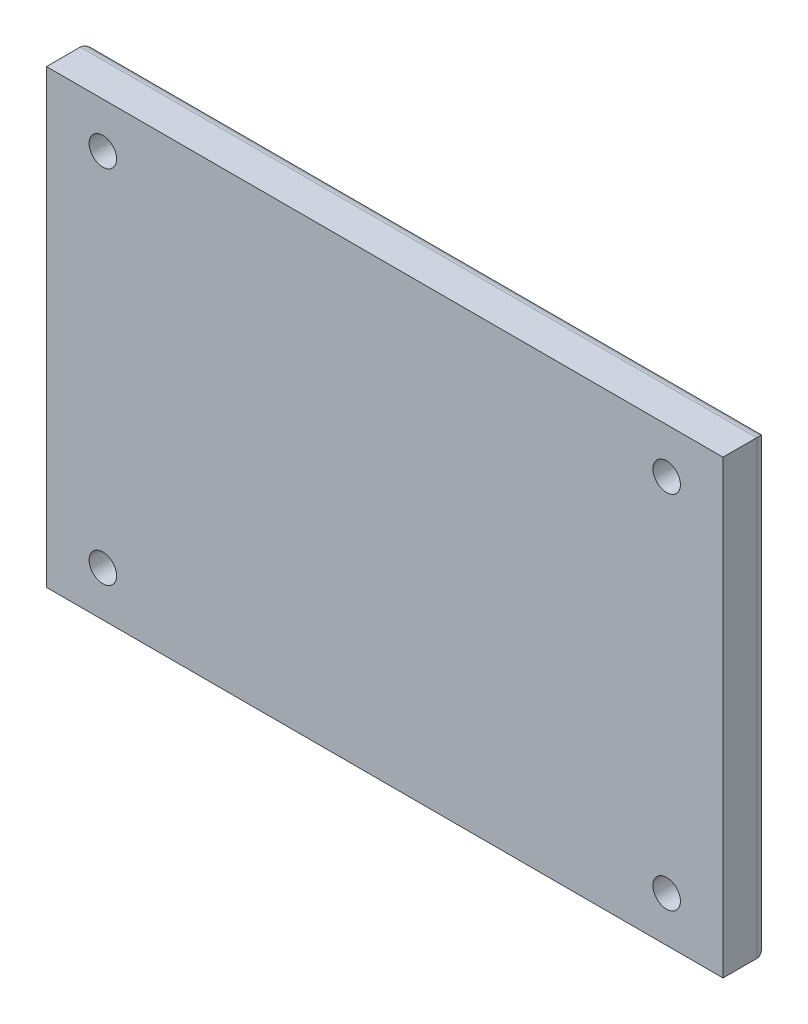
ISO-10303-21;
HEADER;
FILE_DESCRIPTION(('STEP AP214'),'2;1');
FILE_NAME('part.step','',(''),(''),'','','');
FILE_SCHEMA(('AUTOMOTIVE_DESIGN { 1 0 10303 214 1 1 1 1 }'));
ENDSEC;
DATA;
#1=APPLICATION_CONTEXT('core data for automotive mechanical design processes');
#2=APPLICATION_PROTOCOL_DEFINITION('international standard','automotive_design',2000,#1);
#3=PRODUCT_CONTEXT('',#1,'mechanical');
#4=PRODUCT('Part','Part','',(#3));
#5=PRODUCT_RELATED_PRODUCT_CATEGORY('part','',(#4));
#6=PRODUCT_DEFINITION_FORMATION('','',#4);
#7=PRODUCT_DEFINITION_CONTEXT('part definition',#1,'design');
#8=PRODUCT_DEFINITION('design','',#6,#7);
#9=PRODUCT_DEFINITION_SHAPE('','',#8);
#10=(LENGTH_UNIT() NAMED_UNIT(*) SI_UNIT(.MILLI.,.METRE.));
#11=(NAMED_UNIT(*) PLANE_ANGLE_UNIT() SI_UNIT($,.RADIAN.));
#12=(NAMED_UNIT(*) SI_UNIT($,.STERADIAN.) SOLID_ANGLE_UNIT());
#13=UNCERTAINTY_MEASURE_WITH_UNIT(LENGTH_MEASURE(1.E-05),#10,'distance_accuracy_value','');
#14=(GEOMETRIC_REPRESENTATION_CONTEXT(3) GLOBAL_UNCERTAINTY_ASSIGNED_CONTEXT((#13)) GLOBAL_UNIT_ASSIGNED_CONTEXT((#10,
#11,#12)) REPRESENTATION_CONTEXT('',''));
#15=CARTESIAN_POINT('',(0.,0.,0.));
#16=DIRECTION('',(0.,0.,1.));
#17=DIRECTION('',(1.,0.,0.));
#18=AXIS2_PLACEMENT_3D('',#15,#16,#17);
#19=CARTESIAN_POINT('',(30.,20.,4.));
#20=DIRECTION('',(-1.,0.,0.));
#21=DIRECTION('',(0.,0.,1.));
#22=AXIS2_PLACEMENT_3D('',#19,#20,#21);
#23=PLANE('',#22);
#24=DIRECTION('',(0.,0.,-1.));
#25=VECTOR('',#24,1.);
#26=CARTESIAN_POINT('',(30.,-20.,4.));
#27=LINE('',#26,#25);
#28=CARTESIAN_POINT('',(30.,-20.,4.));
#29=VERTEX_POINT('',#28);
#30=CARTESIAN_POINT('',(30.,-20.,1.));
#31=VERTEX_POINT('',#30);
#32=EDGE_CURVE('E192',#29,#31,#27,.T.);
#33=ORIENTED_EDGE('',*,*,#32,.T.);
#34=DIRECTION('',(0.,1.,0.));
#35=VECTOR('',#34,1.);
#36=CARTESIAN_POINT('',(30.,20.,1.));
#37=LINE('',#36,#35);
#38=CARTESIAN_POINT('',(30.,20.,1.));
#39=VERTEX_POINT('',#38);
#40=EDGE_CURVE('E13',#31,#39,#37,.T.);
#41=ORIENTED_EDGE('',*,*,#40,.T.);
#42=DIRECTION('',(0.,0.,-1.));
#43=VECTOR('',#42,1.);
#44=CARTESIAN_POINT('',(30.,20.,4.));
#45=LINE('',#44,#43);
#46=CARTESIAN_POINT('',(30.,20.,4.));
#47=VERTEX_POINT('',#46);
#48=EDGE_CURVE('E109',#47,#39,#45,.T.);
#49=ORIENTED_EDGE('',*,*,#48,.F.);
#50=DIRECTION('',(0.,1.,0.));
#51=VECTOR('',#50,1.);
#52=CARTESIAN_POINT('',(30.,20.,4.));
#53=LINE('',#52,#51);
#54=EDGE_CURVE('E115',#29,#47,#53,.T.);
#55=ORIENTED_EDGE('',*,*,#54,.F.);
#56=EDGE_LOOP('',(#33,#41,#49,#55));
#57=FACE_BOUND('',#56,.T.);
#58=ADVANCED_FACE('F48',(#57),#23,.F.);
#59=CARTESIAN_POINT('',(-30.,20.,4.));
#60=DIRECTION('',(0.,-1.,0.));
#61=DIRECTION('',(0.,0.,-1.));
#62=AXIS2_PLACEMENT_3D('',#59,#60,#61);
#63=PLANE('',#62);
#64=ORIENTED_EDGE('',*,*,#48,.T.);
#65=DIRECTION('',(-1.,0.,0.));
#66=VECTOR('',#65,1.);
#67=CARTESIAN_POINT('',(-30.,20.,1.));
#68=LINE('',#67,#66);
#69=CARTESIAN_POINT('',(-30.,20.,1.));
#70=VERTEX_POINT('',#69);
#71=EDGE_CURVE('E125',#39,#70,#68,.T.);
#72=ORIENTED_EDGE('',*,*,#71,.T.);
#73=DIRECTION('',(0.,0.,-1.));
#74=VECTOR('',#73,1.);
#75=CARTESIAN_POINT('',(-30.,20.,4.));
#76=LINE('',#75,#74);
#77=CARTESIAN_POINT('',(-30.,20.,4.));
#78=VERTEX_POINT('',#77);
#79=EDGE_CURVE('E111',#78,#70,#76,.T.);
#80=ORIENTED_EDGE('',*,*,#79,.F.);
#81=DIRECTION('',(-1.,0.,0.));
#82=VECTOR('',#81,1.);
#83=CARTESIAN_POINT('',(-30.,20.,4.));
#84=LINE('',#83,#82);
#85=EDGE_CURVE('E104',#47,#78,#84,.T.);
#86=ORIENTED_EDGE('',*,*,#85,.F.);
#87=EDGE_LOOP('',(#64,#72,#80,#86));
#88=FACE_BOUND('',#87,.T.);
#89=ADVANCED_FACE('F106',(#88),#63,.F.);
#90=CARTESIAN_POINT('',(-30.,20.,4.));
#91=DIRECTION('',(1.,0.,0.));
#92=DIRECTION('',(0.,0.,-1.));
#93=AXIS2_PLACEMENT_3D('',#90,#91,#92);
#94=PLANE('',#93);
#95=ORIENTED_EDGE('',*,*,#79,.T.);
#96=DIRECTION('',(0.,-1.,0.));
#97=VECTOR('',#96,1.);
#98=CARTESIAN_POINT('',(-30.,20.,1.));
#99=LINE('',#98,#97);
#100=CARTESIAN_POINT('',(-30.,-20.,1.));
#101=VERTEX_POINT('',#100);
#102=EDGE_CURVE('E72',#70,#101,#99,.T.);
#103=ORIENTED_EDGE('',*,*,#102,.T.);
#104=DIRECTION('',(0.,0.,-1.));
#105=VECTOR('',#104,1.);
#106=CARTESIAN_POINT('',(-30.,-20.,4.));
#107=LINE('',#106,#105);
#108=CARTESIAN_POINT('',(-30.,-20.,4.));
#109=VERTEX_POINT('',#108);
#110=EDGE_CURVE('E129',#109,#101,#107,.T.);
#111=ORIENTED_EDGE('',*,*,#110,.F.);
#112=DIRECTION('',(0.,-1.,0.));
#113=VECTOR('',#112,1.);
#114=CARTESIAN_POINT('',(-30.,20.,4.));
#115=LINE('',#114,#113);
#116=EDGE_CURVE('E114',#78,#109,#115,.T.);
#117=ORIENTED_EDGE('',*,*,#116,.F.);
#118=EDGE_LOOP('',(#95,#103,#111,#117));
#119=FACE_BOUND('',#118,.T.);
#120=ADVANCED_FACE('F222',(#119),#94,.F.);
#121=CARTESIAN_POINT('',(-30.,-20.,4.));
#122=DIRECTION('',(0.,1.,0.));
#123=DIRECTION('',(0.,0.,1.));
#124=AXIS2_PLACEMENT_3D('',#121,#122,#123);
#125=PLANE('',#124);
#126=ORIENTED_EDGE('',*,*,#110,.T.);
#127=DIRECTION('',(1.,0.,0.));
#128=VECTOR('',#127,1.);
#129=CARTESIAN_POINT('',(-30.,-20.,1.));
#130=LINE('',#129,#128);
#131=EDGE_CURVE('E57',#101,#31,#130,.T.);
#132=ORIENTED_EDGE('',*,*,#131,.T.);
#133=ORIENTED_EDGE('',*,*,#32,.F.);
#134=DIRECTION('',(1.,0.,0.));
#135=VECTOR('',#134,1.);
#136=CARTESIAN_POINT('',(-30.,-20.,4.));
#137=LINE('',#136,#135);
#138=EDGE_CURVE('E120',#109,#29,#137,.T.);
#139=ORIENTED_EDGE('',*,*,#138,.F.);
#140=EDGE_LOOP('',(#126,#132,#133,#139));
#141=FACE_BOUND('',#140,.T.);
#142=ADVANCED_FACE('F193',(#141),#125,.F.);
#143=CARTESIAN_POINT('',(0.,0.,4.));
#144=DIRECTION('',(0.,0.,1.));
#145=DIRECTION('',(1.,0.,0.));
#146=AXIS2_PLACEMENT_3D('',#143,#144,#145);
#147=PLANE('',#146);
#148=CARTESIAN_POINT('',(-25.,-16.,4.));
#149=DIRECTION('',(0.,0.,1.));
#150=DIRECTION('',(1.,0.,0.));
#151=AXIS2_PLACEMENT_3D('',#148,#149,#150);
#152=CIRCLE('',#151,1.2192);
#153=CARTESIAN_POINT('',(-23.7808,-16.,4.));
#154=VERTEX_POINT('',#153);
#155=EDGE_CURVE('E52',#154,#154,#152,.T.);
#156=ORIENTED_EDGE('',*,*,#155,.F.);
#157=EDGE_LOOP('',(#156));
#158=FACE_BOUND('',#157,.T.);
#159=CARTESIAN_POINT('',(-25.,16.,4.));
#160=DIRECTION('',(0.,0.,1.));
#161=DIRECTION('',(1.,0.,0.));
#162=AXIS2_PLACEMENT_3D('',#159,#160,#161);
#163=CIRCLE('',#162,1.2192);
#164=CARTESIAN_POINT('',(-23.7808,16.,4.));
#165=VERTEX_POINT('',#164);
#166=EDGE_CURVE('E160',#165,#165,#163,.T.);
#167=ORIENTED_EDGE('',*,*,#166,.F.);
#168=EDGE_LOOP('',(#167));
#169=FACE_BOUND('',#168,.T.);
#170=CARTESIAN_POINT('',(25.,16.,4.));
#171=DIRECTION('',(0.,0.,1.));
#172=DIRECTION('',(1.,0.,0.));
#173=AXIS2_PLACEMENT_3D('',#170,#171,#172);
#174=CIRCLE('',#173,1.2192);
#175=CARTESIAN_POINT('',(26.2192,16.,4.));
#176=VERTEX_POINT('',#175);
#177=EDGE_CURVE('E156',#176,#176,#174,.T.);
#178=ORIENTED_EDGE('',*,*,#177,.F.);
#179=EDGE_LOOP('',(#178));
#180=FACE_BOUND('',#179,.T.);
#181=CARTESIAN_POINT('',(25.,-16.,4.));
#182=DIRECTION('',(0.,0.,1.));
#183=DIRECTION('',(1.,0.,0.));
#184=AXIS2_PLACEMENT_3D('',#181,#182,#183);
#185=CIRCLE('',#184,1.2192);
#186=CARTESIAN_POINT('',(26.2192,-16.,4.));
#187=VERTEX_POINT('',#186);
#188=EDGE_CURVE('E146',#187,#187,#185,.T.);
#189=ORIENTED_EDGE('',*,*,#188,.F.);
#190=EDGE_LOOP('',(#189));
#191=FACE_BOUND('',#190,.T.);
#192=ORIENTED_EDGE('',*,*,#54,.T.);
#193=ORIENTED_EDGE('',*,*,#85,.T.);
#194=ORIENTED_EDGE('',*,*,#116,.T.);
#195=ORIENTED_EDGE('',*,*,#138,.T.);
#196=EDGE_LOOP('',(#192,#193,#194,#195));
#197=FACE_BOUND('',#196,.T.);
#198=ADVANCED_FACE('F118',(#158,#169,#180,#191,#197),#147,.T.);
#199=CARTESIAN_POINT('',(0.,0.,0.));
#200=DIRECTION('',(0.,0.,1.));
#201=DIRECTION('',(1.,0.,0.));
#202=AXIS2_PLACEMENT_3D('',#199,#200,#201);
#203=PLANE('',#202);
#204=CARTESIAN_POINT('',(-25.,-16.,0.));
#205=DIRECTION('',(0.,0.,-1.));
#206=DIRECTION('',(-1.,0.,0.));
#207=AXIS2_PLACEMENT_3D('',#204,#205,#206);
#208=CIRCLE('',#207,2.38125);
#209=CARTESIAN_POINT('',(-27.38125,-16.,0.));
#210=VERTEX_POINT('',#209);
#211=EDGE_CURVE('E402',#210,#210,#208,.T.);
#212=ORIENTED_EDGE('',*,*,#211,.F.);
#213=EDGE_LOOP('',(#212));
#214=FACE_BOUND('',#213,.T.);
#215=CARTESIAN_POINT('',(-25.,16.,0.));
#216=DIRECTION('',(0.,0.,-1.));
#217=DIRECTION('',(-1.,0.,0.));
#218=AXIS2_PLACEMENT_3D('',#215,#216,#217);
#219=CIRCLE('',#218,2.38125);
#220=CARTESIAN_POINT('',(-27.38125,16.,0.));
#221=VERTEX_POINT('',#220);
#222=EDGE_CURVE('E175',#221,#221,#219,.T.);
#223=ORIENTED_EDGE('',*,*,#222,.F.);
#224=EDGE_LOOP('',(#223));
#225=FACE_BOUND('',#224,.T.);
#226=CARTESIAN_POINT('',(25.,16.,0.));
#227=DIRECTION('',(0.,0.,-1.));
#228=DIRECTION('',(-1.,0.,0.));
#229=AXIS2_PLACEMENT_3D('',#226,#227,#228);
#230=CIRCLE('',#229,2.38125);
#231=CARTESIAN_POINT('',(22.61875,16.,0.));
#232=VERTEX_POINT('',#231);
#233=EDGE_CURVE('E162',#232,#232,#230,.T.);
#234=ORIENTED_EDGE('',*,*,#233,.F.);
#235=EDGE_LOOP('',(#234));
#236=FACE_BOUND('',#235,.T.);
#237=CARTESIAN_POINT('',(25.,-16.,0.));
#238=DIRECTION('',(0.,0.,-1.));
#239=DIRECTION('',(-1.,0.,0.));
#240=AXIS2_PLACEMENT_3D('',#237,#238,#239);
#241=CIRCLE('',#240,2.38125);
#242=CARTESIAN_POINT('',(22.61875,-16.,0.));
#243=VERTEX_POINT('',#242);
#244=EDGE_CURVE('E158',#243,#243,#241,.T.);
#245=ORIENTED_EDGE('',*,*,#244,.F.);
#246=EDGE_LOOP('',(#245));
#247=FACE_BOUND('',#246,.T.);
#248=DIRECTION('',(0.,-1.,0.));
#249=VECTOR('',#248,1.);
#250=CARTESIAN_POINT('',(-29.,0.,0.));
#251=LINE('',#250,#249);
#252=CARTESIAN_POINT('',(-29.,-19.,0.));
#253=VERTEX_POINT('',#252);
#254=CARTESIAN_POINT('',(-29.,19.,0.));
#255=VERTEX_POINT('',#254);
#256=EDGE_CURVE('E136',#253,#255,#251,.F.);
#257=ORIENTED_EDGE('',*,*,#256,.T.);
#258=DIRECTION('',(-1.,0.,0.));
#259=VECTOR('',#258,1.);
#260=CARTESIAN_POINT('',(0.,19.,0.));
#261=LINE('',#260,#259);
#262=CARTESIAN_POINT('',(29.,19.,0.));
#263=VERTEX_POINT('',#262);
#264=EDGE_CURVE('E138',#255,#263,#261,.F.);
#265=ORIENTED_EDGE('',*,*,#264,.T.);
#266=DIRECTION('',(0.,1.,0.));
#267=VECTOR('',#266,1.);
#268=CARTESIAN_POINT('',(29.,0.,0.));
#269=LINE('',#268,#267);
#270=CARTESIAN_POINT('',(29.,-19.,0.));
#271=VERTEX_POINT('',#270);
#272=EDGE_CURVE('E127',#263,#271,#269,.F.);
#273=ORIENTED_EDGE('',*,*,#272,.T.);
#274=DIRECTION('',(1.,0.,0.));
#275=VECTOR('',#274,1.);
#276=CARTESIAN_POINT('',(0.,-19.,0.));
#277=LINE('',#276,#275);
#278=EDGE_CURVE('E134',#271,#253,#277,.F.);
#279=ORIENTED_EDGE('',*,*,#278,.T.);
#280=EDGE_LOOP('',(#257,#265,#273,#279));
#281=FACE_BOUND('',#280,.T.);
#282=ADVANCED_FACE('F204',(#214,#225,#236,#247,#281),#203,.F.);
#283=CARTESIAN_POINT('',(-30.,-19.,1.));
#284=DIRECTION('',(1.,0.,0.));
#285=DIRECTION('',(0.,0.,-1.));
#286=AXIS2_PLACEMENT_3D('',#283,#284,#285);
#287=CYLINDRICAL_SURFACE('',#286,1.);
#288=CARTESIAN_POINT('',(-29.,-19.,1.));
#289=DIRECTION('',(0.707106781186547,-0.707106781186547,0.));
#290=DIRECTION('',(0.707106781186547,0.707106781186547,0.));
#291=AXIS2_PLACEMENT_3D('',#288,#289,#290);
#292=ELLIPSE('',#291,1.41421356237309,1.);
#293=EDGE_CURVE('E148',#253,#101,#292,.F.);
#294=ORIENTED_EDGE('',*,*,#293,.F.);
#295=ORIENTED_EDGE('',*,*,#278,.F.);
#296=CARTESIAN_POINT('',(29.,-19.,1.));
#297=DIRECTION('',(0.707106781186547,0.707106781186547,0.));
#298=DIRECTION('',(-0.707106781186547,0.707106781186547,0.));
#299=AXIS2_PLACEMENT_3D('',#296,#297,#298);
#300=ELLIPSE('',#299,1.41421356237309,1.);
#301=EDGE_CURVE('E122',#31,#271,#300,.T.);
#302=ORIENTED_EDGE('',*,*,#301,.F.);
#303=ORIENTED_EDGE('',*,*,#131,.F.);
#304=EDGE_LOOP('',(#294,#295,#302,#303));
#305=FACE_BOUND('',#304,.T.);
#306=ADVANCED_FACE('F50',(#305),#287,.T.);
#307=CARTESIAN_POINT('',(29.,20.,1.));
#308=DIRECTION('',(0.,1.,0.));
#309=DIRECTION('',(0.,0.,1.));
#310=AXIS2_PLACEMENT_3D('',#307,#308,#309);
#311=CYLINDRICAL_SURFACE('',#310,1.);
#312=ORIENTED_EDGE('',*,*,#301,.T.);
#313=ORIENTED_EDGE('',*,*,#272,.F.);
#314=CARTESIAN_POINT('',(29.,19.,1.));
#315=DIRECTION('',(-0.707106781186547,0.707106781186547,0.));
#316=DIRECTION('',(0.707106781186547,0.707106781186547,0.));
#317=AXIS2_PLACEMENT_3D('',#314,#315,#316);
#318=ELLIPSE('',#317,1.41421356237309,1.);
#319=EDGE_CURVE('E145',#39,#263,#318,.T.);
#320=ORIENTED_EDGE('',*,*,#319,.F.);
#321=ORIENTED_EDGE('',*,*,#40,.F.);
#322=EDGE_LOOP('',(#312,#313,#320,#321));
#323=FACE_BOUND('',#322,.T.);
#324=ADVANCED_FACE('F210',(#323),#311,.T.);
#325=CARTESIAN_POINT('',(-29.,20.,1.));
#326=DIRECTION('',(0.,-1.,0.));
#327=DIRECTION('',(0.,0.,-1.));
#328=AXIS2_PLACEMENT_3D('',#325,#326,#327);
#329=CYLINDRICAL_SURFACE('',#328,1.);
#330=ORIENTED_EDGE('',*,*,#293,.T.);
#331=ORIENTED_EDGE('',*,*,#102,.F.);
#332=CARTESIAN_POINT('',(-29.,19.,1.));
#333=DIRECTION('',(-0.707106781186547,-0.707106781186547,0.));
#334=DIRECTION('',(0.707106781186547,-0.707106781186547,0.));
#335=AXIS2_PLACEMENT_3D('',#332,#333,#334);
#336=ELLIPSE('',#335,1.41421356237309,1.);
#337=EDGE_CURVE('E143',#255,#70,#336,.F.);
#338=ORIENTED_EDGE('',*,*,#337,.F.);
#339=ORIENTED_EDGE('',*,*,#256,.F.);
#340=EDGE_LOOP('',(#330,#331,#338,#339));
#341=FACE_BOUND('',#340,.T.);
#342=ADVANCED_FACE('F200',(#341),#329,.T.);
#343=CARTESIAN_POINT('',(-30.,19.,1.));
#344=DIRECTION('',(-1.,0.,0.));
#345=DIRECTION('',(0.,0.,1.));
#346=AXIS2_PLACEMENT_3D('',#343,#344,#345);
#347=CYLINDRICAL_SURFACE('',#346,1.);
#348=ORIENTED_EDGE('',*,*,#319,.T.);
#349=ORIENTED_EDGE('',*,*,#264,.F.);
#350=ORIENTED_EDGE('',*,*,#337,.T.);
#351=ORIENTED_EDGE('',*,*,#71,.F.);
#352=EDGE_LOOP('',(#348,#349,#350,#351));
#353=FACE_BOUND('',#352,.T.);
#354=ADVANCED_FACE('F206',(#353),#347,.T.);
#355=CARTESIAN_POINT('',(25.,-16.,0.));
#356=DIRECTION('',(0.,0.,-1.));
#357=DIRECTION('',(-1.,0.,0.));
#358=AXIS2_PLACEMENT_3D('',#355,#356,#357);
#359=CYLINDRICAL_SURFACE('',#358,1.2192);
#360=ORIENTED_EDGE('',*,*,#188,.T.);
#361=EDGE_LOOP('',(#360));
#362=FACE_BOUND('',#361,.T.);
#363=CARTESIAN_POINT('',(25.,-16.,2.1844));
#364=DIRECTION('',(0.,0.,-1.));
#365=DIRECTION('',(-1.,0.,0.));
#366=AXIS2_PLACEMENT_3D('',#363,#364,#365);
#367=CIRCLE('',#366,1.2192);
#368=CARTESIAN_POINT('',(23.7808,-16.,2.1844));
#369=VERTEX_POINT('',#368);
#370=EDGE_CURVE('E155',#369,#369,#367,.T.);
#371=ORIENTED_EDGE('',*,*,#370,.T.);
#372=EDGE_LOOP('',(#371));
#373=FACE_BOUND('',#372,.T.);
#374=ADVANCED_FACE('F227',(#362,#373),#359,.F.);
#375=CARTESIAN_POINT('',(26.2192,-16.,2.1844));
#376=DIRECTION('',(0.,0.,1.));
#377=DIRECTION('',(1.,0.,0.));
#378=AXIS2_PLACEMENT_3D('',#375,#376,#377);
#379=PLANE('',#378);
#380=ORIENTED_EDGE('',*,*,#370,.F.);
#381=EDGE_LOOP('',(#380));
#382=FACE_BOUND('',#381,.T.);
#383=CARTESIAN_POINT('',(25.,-16.,2.1844));
#384=DIRECTION('',(0.,0.,-1.));
#385=DIRECTION('',(-1.,0.,0.));
#386=AXIS2_PLACEMENT_3D('',#383,#384,#385);
#387=CIRCLE('',#386,2.38125);
#388=CARTESIAN_POINT('',(22.61875,-16.,2.1844));
#389=VERTEX_POINT('',#388);
#390=EDGE_CURVE('E185',#389,#389,#387,.T.);
#391=ORIENTED_EDGE('',*,*,#390,.T.);
#392=EDGE_LOOP('',(#391));
#393=FACE_BOUND('',#392,.T.);
#394=ADVANCED_FACE('F231',(#382,#393),#379,.F.);
#395=CARTESIAN_POINT('',(25.,-16.,0.));
#396=DIRECTION('',(0.,0.,-1.));
#397=DIRECTION('',(-1.,0.,0.));
#398=AXIS2_PLACEMENT_3D('',#395,#396,#397);
#399=CYLINDRICAL_SURFACE('',#398,2.38125);
#400=ORIENTED_EDGE('',*,*,#390,.F.);
#401=EDGE_LOOP('',(#400));
#402=FACE_BOUND('',#401,.T.);
#403=ORIENTED_EDGE('',*,*,#244,.T.);
#404=EDGE_LOOP('',(#403));
#405=FACE_BOUND('',#404,.T.);
#406=ADVANCED_FACE('F237',(#402,#405),#399,.F.);
#407=CARTESIAN_POINT('',(25.,16.,0.));
#408=DIRECTION('',(0.,0.,-1.));
#409=DIRECTION('',(-1.,0.,0.));
#410=AXIS2_PLACEMENT_3D('',#407,#408,#409);
#411=CYLINDRICAL_SURFACE('',#410,1.2192);
#412=ORIENTED_EDGE('',*,*,#177,.T.);
#413=EDGE_LOOP('',(#412));
#414=FACE_BOUND('',#413,.T.);
#415=CARTESIAN_POINT('',(25.,16.,2.1844));
#416=DIRECTION('',(0.,0.,-1.));
#417=DIRECTION('',(-1.,0.,0.));
#418=AXIS2_PLACEMENT_3D('',#415,#416,#417);
#419=CIRCLE('',#418,1.2192);
#420=CARTESIAN_POINT('',(23.7808,16.,2.1844));
#421=VERTEX_POINT('',#420);
#422=EDGE_CURVE('E159',#421,#421,#419,.T.);
#423=ORIENTED_EDGE('',*,*,#422,.T.);
#424=EDGE_LOOP('',(#423));
#425=FACE_BOUND('',#424,.T.);
#426=ADVANCED_FACE('F304',(#414,#425),#411,.F.);
#427=CARTESIAN_POINT('',(26.2192,16.,2.1844));
#428=DIRECTION('',(0.,0.,1.));
#429=DIRECTION('',(1.,0.,0.));
#430=AXIS2_PLACEMENT_3D('',#427,#428,#429);
#431=PLANE('',#430);
#432=ORIENTED_EDGE('',*,*,#422,.F.);
#433=EDGE_LOOP('',(#432));
#434=FACE_BOUND('',#433,.T.);
#435=CARTESIAN_POINT('',(25.,16.,2.1844));
#436=DIRECTION('',(0.,0.,-1.));
#437=DIRECTION('',(-1.,0.,0.));
#438=AXIS2_PLACEMENT_3D('',#435,#436,#437);
#439=CIRCLE('',#438,2.38125);
#440=CARTESIAN_POINT('',(22.61875,16.,2.1844));
#441=VERTEX_POINT('',#440);
#442=EDGE_CURVE('E167',#441,#441,#439,.T.);
#443=ORIENTED_EDGE('',*,*,#442,.T.);
#444=EDGE_LOOP('',(#443));
#445=FACE_BOUND('',#444,.T.);
#446=ADVANCED_FACE('F312',(#434,#445),#431,.F.);
#447=CARTESIAN_POINT('',(25.,16.,0.));
#448=DIRECTION('',(0.,0.,-1.));
#449=DIRECTION('',(-1.,0.,0.));
#450=AXIS2_PLACEMENT_3D('',#447,#448,#449);
#451=CYLINDRICAL_SURFACE('',#450,2.38125);
#452=ORIENTED_EDGE('',*,*,#442,.F.);
#453=EDGE_LOOP('',(#452));
#454=FACE_BOUND('',#453,.T.);
#455=ORIENTED_EDGE('',*,*,#233,.T.);
#456=EDGE_LOOP('',(#455));
#457=FACE_BOUND('',#456,.T.);
#458=ADVANCED_FACE('F321',(#454,#457),#451,.F.);
#459=CARTESIAN_POINT('',(-25.,16.,0.));
#460=DIRECTION('',(0.,0.,-1.));
#461=DIRECTION('',(-1.,0.,0.));
#462=AXIS2_PLACEMENT_3D('',#459,#460,#461);
#463=CYLINDRICAL_SURFACE('',#462,1.2192);
#464=ORIENTED_EDGE('',*,*,#166,.T.);
#465=EDGE_LOOP('',(#464));
#466=FACE_BOUND('',#465,.T.);
#467=CARTESIAN_POINT('',(-25.,16.,2.1844));
#468=DIRECTION('',(0.,0.,-1.));
#469=DIRECTION('',(-1.,0.,0.));
#470=AXIS2_PLACEMENT_3D('',#467,#468,#469);
#471=CIRCLE('',#470,1.2192);
#472=CARTESIAN_POINT('',(-26.2192,16.,2.1844));
#473=VERTEX_POINT('',#472);
#474=EDGE_CURVE('E163',#473,#473,#471,.T.);
#475=ORIENTED_EDGE('',*,*,#474,.T.);
#476=EDGE_LOOP('',(#475));
#477=FACE_BOUND('',#476,.T.);
#478=ADVANCED_FACE('F330',(#466,#477),#463,.F.);
#479=CARTESIAN_POINT('',(-23.7808,16.,2.1844));
#480=DIRECTION('',(0.,0.,1.));
#481=DIRECTION('',(1.,0.,0.));
#482=AXIS2_PLACEMENT_3D('',#479,#480,#481);
#483=PLANE('',#482);
#484=ORIENTED_EDGE('',*,*,#474,.F.);
#485=EDGE_LOOP('',(#484));
#486=FACE_BOUND('',#485,.T.);
#487=CARTESIAN_POINT('',(-25.,16.,2.1844));
#488=DIRECTION('',(0.,0.,-1.));
#489=DIRECTION('',(-1.,0.,0.));
#490=AXIS2_PLACEMENT_3D('',#487,#488,#489);
#491=CIRCLE('',#490,2.38125);
#492=CARTESIAN_POINT('',(-27.38125,16.,2.1844));
#493=VERTEX_POINT('',#492);
#494=EDGE_CURVE('E170',#493,#493,#491,.T.);
#495=ORIENTED_EDGE('',*,*,#494,.T.);
#496=EDGE_LOOP('',(#495));
#497=FACE_BOUND('',#496,.T.);
#498=ADVANCED_FACE('F339',(#486,#497),#483,.F.);
#499=CARTESIAN_POINT('',(-25.,16.,0.));
#500=DIRECTION('',(0.,0.,-1.));
#501=DIRECTION('',(-1.,0.,0.));
#502=AXIS2_PLACEMENT_3D('',#499,#500,#501);
#503=CYLINDRICAL_SURFACE('',#502,2.38125);
#504=ORIENTED_EDGE('',*,*,#494,.F.);
#505=EDGE_LOOP('',(#504));
#506=FACE_BOUND('',#505,.T.);
#507=ORIENTED_EDGE('',*,*,#222,.T.);
#508=EDGE_LOOP('',(#507));
#509=FACE_BOUND('',#508,.T.);
#510=ADVANCED_FACE('F347',(#506,#509),#503,.F.);
#511=CARTESIAN_POINT('',(-25.,-16.,0.));
#512=DIRECTION('',(0.,0.,-1.));
#513=DIRECTION('',(-1.,0.,0.));
#514=AXIS2_PLACEMENT_3D('',#511,#512,#513);
#515=CYLINDRICAL_SURFACE('',#514,1.2192);
#516=ORIENTED_EDGE('',*,*,#155,.T.);
#517=EDGE_LOOP('',(#516));
#518=FACE_BOUND('',#517,.T.);
#519=CARTESIAN_POINT('',(-25.,-16.,2.1844));
#520=DIRECTION('',(0.,0.,-1.));
#521=DIRECTION('',(-1.,0.,0.));
#522=AXIS2_PLACEMENT_3D('',#519,#520,#521);
#523=CIRCLE('',#522,1.2192);
#524=CARTESIAN_POINT('',(-26.2192,-16.,2.1844));
#525=VERTEX_POINT('',#524);
#526=EDGE_CURVE('E404',#525,#525,#523,.T.);
#527=ORIENTED_EDGE('',*,*,#526,.T.);
#528=EDGE_LOOP('',(#527));
#529=FACE_BOUND('',#528,.T.);
#530=ADVANCED_FACE('F356',(#518,#529),#515,.F.);
#531=CARTESIAN_POINT('',(-23.7808,-16.,2.1844));
#532=DIRECTION('',(0.,0.,1.));
#533=DIRECTION('',(1.,0.,0.));
#534=AXIS2_PLACEMENT_3D('',#531,#532,#533);
#535=PLANE('',#534);
#536=ORIENTED_EDGE('',*,*,#526,.F.);
#537=EDGE_LOOP('',(#536));
#538=FACE_BOUND('',#537,.T.);
#539=CARTESIAN_POINT('',(-25.,-16.,2.1844));
#540=DIRECTION('',(0.,0.,-1.));
#541=DIRECTION('',(-1.,0.,0.));
#542=AXIS2_PLACEMENT_3D('',#539,#540,#541);
#543=CIRCLE('',#542,2.38125);
#544=CARTESIAN_POINT('',(-27.38125,-16.,2.1844));
#545=VERTEX_POINT('',#544);
#546=EDGE_CURVE('E399',#545,#545,#543,.T.);
#547=ORIENTED_EDGE('',*,*,#546,.T.);
#548=EDGE_LOOP('',(#547));
#549=FACE_BOUND('',#548,.T.);
#550=ADVANCED_FACE('F365',(#538,#549),#535,.F.);
#551=CARTESIAN_POINT('',(-25.,-16.,0.));
#552=DIRECTION('',(0.,0.,-1.));
#553=DIRECTION('',(-1.,0.,0.));
#554=AXIS2_PLACEMENT_3D('',#551,#552,#553);
#555=CYLINDRICAL_SURFACE('',#554,2.38125);
#556=ORIENTED_EDGE('',*,*,#546,.F.);
#557=EDGE_LOOP('',(#556));
#558=FACE_BOUND('',#557,.T.);
#559=ORIENTED_EDGE('',*,*,#211,.T.);
#560=EDGE_LOOP('',(#559));
#561=FACE_BOUND('',#560,.T.);
#562=ADVANCED_FACE('F374',(#558,#561),#555,.F.);
#563=CLOSED_SHELL('',(#58,#89,#120,#142,#198,#282,#306,#324,#342,#354,#374,#394,#406,#426,#446,
#458,#478,#498,#510,#530,#550,#562));
#564=MANIFOLD_SOLID_BREP('B2',#563);
#565=ADVANCED_BREP_SHAPE_REPRESENTATION('',(#18,#564),#14);
#566=SHAPE_DEFINITION_REPRESENTATION(#9,#565);
ENDSEC;
END-ISO-10303-21;
